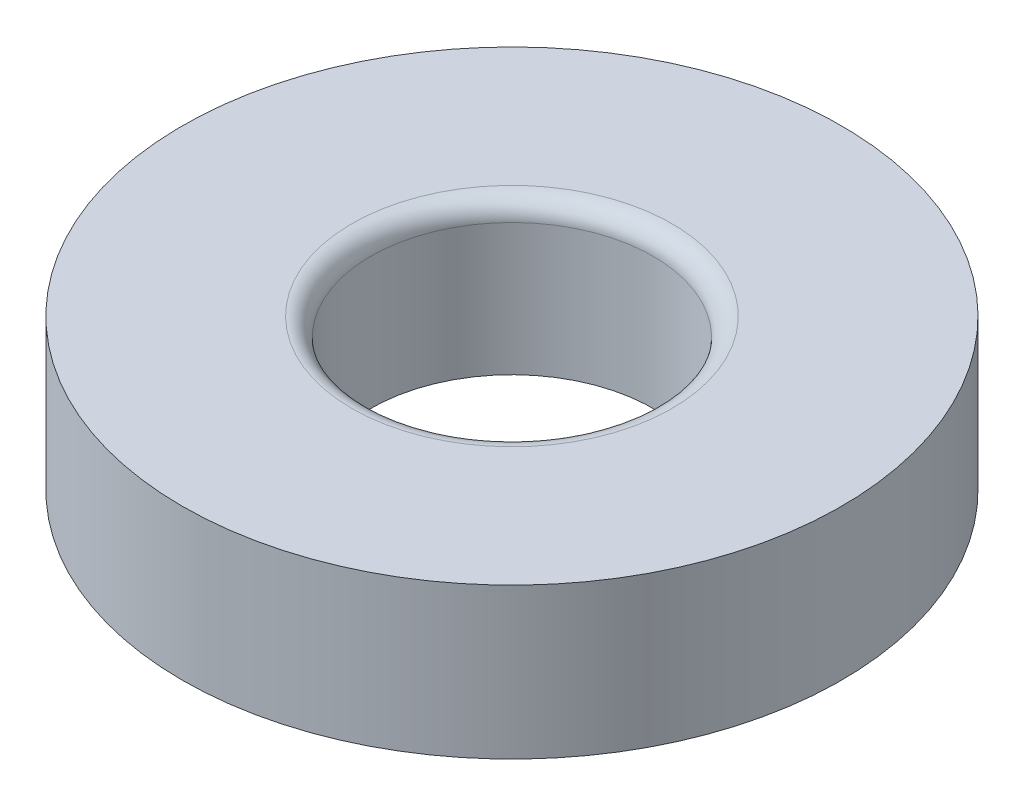
ISO-10303-21;
HEADER;
FILE_DESCRIPTION(('STEP AP214'),'2;1');
FILE_NAME('part.step','',(''),(''),'','','');
FILE_SCHEMA(('AUTOMOTIVE_DESIGN { 1 0 10303 214 1 1 1 1 }'));
ENDSEC;
DATA;
#1=APPLICATION_CONTEXT('core data for automotive mechanical design processes');
#2=APPLICATION_PROTOCOL_DEFINITION('international standard','automotive_design',2000,#1);
#3=PRODUCT_CONTEXT('',#1,'mechanical');
#4=PRODUCT('Part','Part','',(#3));
#5=PRODUCT_RELATED_PRODUCT_CATEGORY('part','',(#4));
#6=PRODUCT_DEFINITION_FORMATION('','',#4);
#7=PRODUCT_DEFINITION_CONTEXT('part definition',#1,'design');
#8=PRODUCT_DEFINITION('design','',#6,#7);
#9=PRODUCT_DEFINITION_SHAPE('','',#8);
#10=(LENGTH_UNIT() NAMED_UNIT(*) SI_UNIT(.MILLI.,.METRE.));
#11=(NAMED_UNIT(*) PLANE_ANGLE_UNIT() SI_UNIT($,.RADIAN.));
#12=(NAMED_UNIT(*) SI_UNIT($,.STERADIAN.) SOLID_ANGLE_UNIT());
#13=UNCERTAINTY_MEASURE_WITH_UNIT(LENGTH_MEASURE(1.E-05),#10,'distance_accuracy_value','');
#14=(GEOMETRIC_REPRESENTATION_CONTEXT(3) GLOBAL_UNCERTAINTY_ASSIGNED_CONTEXT((#13)) GLOBAL_UNIT_ASSIGNED_CONTEXT((#10,
#11,#12)) REPRESENTATION_CONTEXT('',''));
#15=CARTESIAN_POINT('',(0.,0.,0.));
#16=DIRECTION('',(0.,0.,1.));
#17=DIRECTION('',(1.,0.,0.));
#18=AXIS2_PLACEMENT_3D('',#15,#16,#17);
#19=CARTESIAN_POINT('',(0.,8.,0.));
#20=DIRECTION('',(0.,-1.,0.));
#21=DIRECTION('',(0.,0.,-1.));
#22=AXIS2_PLACEMENT_3D('',#19,#20,#21);
#23=CYLINDRICAL_SURFACE('',#22,17.5);
#24=CARTESIAN_POINT('',(0.,8.,0.));
#25=DIRECTION('',(0.,1.,0.));
#26=DIRECTION('',(0.,0.,1.));
#27=AXIS2_PLACEMENT_3D('',#24,#25,#26);
#28=CIRCLE('',#27,17.5);
#29=CARTESIAN_POINT('',(0.,8.,17.5));
#30=VERTEX_POINT('',#29);
#31=EDGE_CURVE('E44',#30,#30,#28,.T.);
#32=ORIENTED_EDGE('',*,*,#31,.F.);
#33=EDGE_LOOP('',(#32));
#34=FACE_BOUND('',#33,.T.);
#35=CARTESIAN_POINT('',(0.,0.,0.));
#36=DIRECTION('',(0.,1.,0.));
#37=DIRECTION('',(0.,0.,1.));
#38=AXIS2_PLACEMENT_3D('',#35,#36,#37);
#39=CIRCLE('',#38,17.5);
#40=CARTESIAN_POINT('',(0.,0.,17.5));
#41=VERTEX_POINT('',#40);
#42=EDGE_CURVE('E48',#41,#41,#39,.T.);
#43=ORIENTED_EDGE('',*,*,#42,.T.);
#44=EDGE_LOOP('',(#43));
#45=FACE_BOUND('',#44,.T.);
#46=ADVANCED_FACE('F33',(#34,#45),#23,.T.);
#47=CARTESIAN_POINT('',(0.,8.,0.));
#48=DIRECTION('',(0.,1.,0.));
#49=DIRECTION('',(0.,0.,1.));
#50=AXIS2_PLACEMENT_3D('',#47,#48,#49);
#51=PLANE('',#50);
#52=CARTESIAN_POINT('',(0.,8.,0.));
#53=DIRECTION('',(0.,1.,0.));
#54=DIRECTION('',(0.,0.,1.));
#55=AXIS2_PLACEMENT_3D('',#52,#53,#54);
#56=CIRCLE('',#55,8.5);
#57=CARTESIAN_POINT('',(0.,8.,8.5));
#58=VERTEX_POINT('',#57);
#59=EDGE_CURVE('E10',#58,#58,#56,.F.);
#60=ORIENTED_EDGE('',*,*,#59,.T.);
#61=EDGE_LOOP('',(#60));
#62=FACE_BOUND('',#61,.T.);
#63=ORIENTED_EDGE('',*,*,#31,.T.);
#64=EDGE_LOOP('',(#63));
#65=FACE_BOUND('',#64,.T.);
#66=ADVANCED_FACE('F68',(#62,#65),#51,.T.);
#67=CARTESIAN_POINT('',(0.,0.,0.));
#68=DIRECTION('',(0.,1.,0.));
#69=DIRECTION('',(0.,0.,1.));
#70=AXIS2_PLACEMENT_3D('',#67,#68,#69);
#71=PLANE('',#70);
#72=CARTESIAN_POINT('',(0.,0.,0.));
#73=DIRECTION('',(0.,1.,0.));
#74=DIRECTION('',(0.,0.,1.));
#75=AXIS2_PLACEMENT_3D('',#72,#73,#74);
#76=CIRCLE('',#75,7.5);
#77=CARTESIAN_POINT('',(0.,0.,7.5));
#78=VERTEX_POINT('',#77);
#79=EDGE_CURVE('E52',#78,#78,#76,.T.);
#80=ORIENTED_EDGE('',*,*,#79,.T.);
#81=EDGE_LOOP('',(#80));
#82=FACE_BOUND('',#81,.T.);
#83=ORIENTED_EDGE('',*,*,#42,.F.);
#84=EDGE_LOOP('',(#83));
#85=FACE_BOUND('',#84,.T.);
#86=ADVANCED_FACE('F57',(#82,#85),#71,.F.);
#87=CARTESIAN_POINT('',(0.,0.,0.));
#88=DIRECTION('',(0.,1.,0.));
#89=DIRECTION('',(0.,0.,1.));
#90=AXIS2_PLACEMENT_3D('',#87,#88,#89);
#91=CYLINDRICAL_SURFACE('',#90,7.5);
#92=CARTESIAN_POINT('',(0.,7.,0.));
#93=DIRECTION('',(0.,1.,0.));
#94=DIRECTION('',(0.,0.,1.));
#95=AXIS2_PLACEMENT_3D('',#92,#93,#94);
#96=CIRCLE('',#95,7.5);
#97=CARTESIAN_POINT('',(0.,7.,7.5));
#98=VERTEX_POINT('',#97);
#99=EDGE_CURVE('E40',#98,#98,#96,.T.);
#100=ORIENTED_EDGE('',*,*,#99,.T.);
#101=EDGE_LOOP('',(#100));
#102=FACE_BOUND('',#101,.T.);
#103=ORIENTED_EDGE('',*,*,#79,.F.);
#104=EDGE_LOOP('',(#103));
#105=FACE_BOUND('',#104,.T.);
#106=ADVANCED_FACE('F60',(#102,#105),#91,.F.);
#107=CARTESIAN_POINT('',(0.,7.,0.));
#108=DIRECTION('',(0.,1.,0.));
#109=DIRECTION('',(0.,0.,1.));
#110=AXIS2_PLACEMENT_3D('',#107,#108,#109);
#111=TOROIDAL_SURFACE('',#110,8.5,1.);
#112=ORIENTED_EDGE('',*,*,#59,.F.);
#113=EDGE_LOOP('',(#112));
#114=FACE_BOUND('',#113,.T.);
#115=ORIENTED_EDGE('',*,*,#99,.F.);
#116=EDGE_LOOP('',(#115));
#117=FACE_BOUND('',#116,.T.);
#118=ADVANCED_FACE('F35',(#114,#117),#111,.T.);
#119=CLOSED_SHELL('',(#46,#66,#86,#106,#118));
#120=MANIFOLD_SOLID_BREP('B2',#119);
#121=ADVANCED_BREP_SHAPE_REPRESENTATION('',(#18,#120),#14);
#122=SHAPE_DEFINITION_REPRESENTATION(#9,#121);
ENDSEC;
END-ISO-10303-21;
